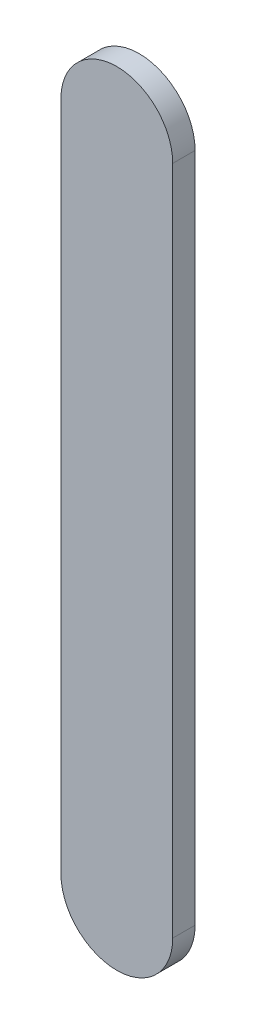
ISO-10303-21;
HEADER;
FILE_DESCRIPTION(('STEP AP214'),'2;1');
FILE_NAME('part.step','',(''),(''),'','','');
FILE_SCHEMA(('AUTOMOTIVE_DESIGN { 1 0 10303 214 1 1 1 1 }'));
ENDSEC;
DATA;
#1=APPLICATION_CONTEXT('core data for automotive mechanical design processes');
#2=APPLICATION_PROTOCOL_DEFINITION('international standard','automotive_design',2000,#1);
#3=PRODUCT_CONTEXT('',#1,'mechanical');
#4=PRODUCT('Part','Part','',(#3));
#5=PRODUCT_RELATED_PRODUCT_CATEGORY('part','',(#4));
#6=PRODUCT_DEFINITION_FORMATION('','',#4);
#7=PRODUCT_DEFINITION_CONTEXT('part definition',#1,'design');
#8=PRODUCT_DEFINITION('design','',#6,#7);
#9=PRODUCT_DEFINITION_SHAPE('','',#8);
#10=(LENGTH_UNIT() NAMED_UNIT(*) SI_UNIT(.MILLI.,.METRE.));
#11=(NAMED_UNIT(*) PLANE_ANGLE_UNIT() SI_UNIT($,.RADIAN.));
#12=(NAMED_UNIT(*) SI_UNIT($,.STERADIAN.) SOLID_ANGLE_UNIT());
#13=UNCERTAINTY_MEASURE_WITH_UNIT(LENGTH_MEASURE(1.E-05),#10,'distance_accuracy_value','');
#14=(GEOMETRIC_REPRESENTATION_CONTEXT(3) GLOBAL_UNCERTAINTY_ASSIGNED_CONTEXT((#13)) GLOBAL_UNIT_ASSIGNED_CONTEXT((#10,
#11,#12)) REPRESENTATION_CONTEXT('',''));
#15=CARTESIAN_POINT('',(0.,0.,0.));
#16=DIRECTION('',(0.,0.,1.));
#17=DIRECTION('',(1.,0.,0.));
#18=AXIS2_PLACEMENT_3D('',#15,#16,#17);
#19=CARTESIAN_POINT('',(6.7837892790863,6.57953159139589,1.));
#20=DIRECTION('',(0.,0.,-1.));
#21=DIRECTION('',(-1.,0.,0.));
#22=AXIS2_PLACEMENT_3D('',#19,#20,#21);
#23=CYLINDRICAL_SURFACE('',#22,2.5);
#24=CARTESIAN_POINT('',(6.7837892790863,6.57953159139589,0.));
#25=DIRECTION('',(0.,0.,1.));
#26=DIRECTION('',(1.,0.,0.));
#27=AXIS2_PLACEMENT_3D('',#24,#25,#26);
#28=CIRCLE('',#27,2.5);
#29=CARTESIAN_POINT('',(9.2837892790863,6.57953159139589,0.));
#30=VERTEX_POINT('',#29);
#31=CARTESIAN_POINT('',(4.2837892790863,6.57953159139589,0.));
#32=VERTEX_POINT('',#31);
#33=EDGE_CURVE('E106',#30,#32,#28,.T.);
#34=ORIENTED_EDGE('',*,*,#33,.T.);
#35=DIRECTION('',(0.,0.,-1.));
#36=VECTOR('',#35,1.);
#37=CARTESIAN_POINT('',(4.2837892790863,6.57953159139589,1.));
#38=LINE('',#37,#36);
#39=CARTESIAN_POINT('',(4.2837892790863,6.57953159139589,1.));
#40=VERTEX_POINT('',#39);
#41=EDGE_CURVE('E13',#40,#32,#38,.T.);
#42=ORIENTED_EDGE('',*,*,#41,.F.);
#43=CARTESIAN_POINT('',(6.7837892790863,6.57953159139589,1.));
#44=DIRECTION('',(0.,0.,1.));
#45=DIRECTION('',(1.,0.,0.));
#46=AXIS2_PLACEMENT_3D('',#43,#44,#45);
#47=CIRCLE('',#46,2.5);
#48=CARTESIAN_POINT('',(9.2837892790863,6.57953159139589,1.));
#49=VERTEX_POINT('',#48);
#50=EDGE_CURVE('E94',#49,#40,#47,.T.);
#51=ORIENTED_EDGE('',*,*,#50,.F.);
#52=DIRECTION('',(0.,0.,-1.));
#53=VECTOR('',#52,1.);
#54=CARTESIAN_POINT('',(9.2837892790863,6.57953159139589,1.));
#55=LINE('',#54,#53);
#56=EDGE_CURVE('E102',#49,#30,#55,.T.);
#57=ORIENTED_EDGE('',*,*,#56,.T.);
#58=EDGE_LOOP('',(#34,#42,#51,#57));
#59=FACE_BOUND('',#58,.T.);
#60=ADVANCED_FACE('F43',(#59),#23,.T.);
#61=CARTESIAN_POINT('',(4.2837892790863,6.57953159139589,1.));
#62=DIRECTION('',(1.,0.,0.));
#63=DIRECTION('',(0.,1.,0.));
#64=AXIS2_PLACEMENT_3D('',#61,#62,#63);
#65=PLANE('',#64);
#66=DIRECTION('',(0.,-1.,0.));
#67=VECTOR('',#66,1.);
#68=CARTESIAN_POINT('',(4.2837892790863,6.57953159139589,0.));
#69=LINE('',#68,#67);
#70=CARTESIAN_POINT('',(4.2837892790863,-23.4204684086041,0.));
#71=VERTEX_POINT('',#70);
#72=EDGE_CURVE('E98',#32,#71,#69,.T.);
#73=ORIENTED_EDGE('',*,*,#72,.T.);
#74=DIRECTION('',(0.,0.,-1.));
#75=VECTOR('',#74,1.);
#76=CARTESIAN_POINT('',(4.2837892790863,-23.4204684086041,1.));
#77=LINE('',#76,#75);
#78=CARTESIAN_POINT('',(4.2837892790863,-23.4204684086041,1.));
#79=VERTEX_POINT('',#78);
#80=EDGE_CURVE('E51',#79,#71,#77,.T.);
#81=ORIENTED_EDGE('',*,*,#80,.F.);
#82=DIRECTION('',(0.,-1.,0.));
#83=VECTOR('',#82,1.);
#84=CARTESIAN_POINT('',(4.2837892790863,6.57953159139589,1.));
#85=LINE('',#84,#83);
#86=EDGE_CURVE('E89',#40,#79,#85,.T.);
#87=ORIENTED_EDGE('',*,*,#86,.F.);
#88=ORIENTED_EDGE('',*,*,#41,.T.);
#89=EDGE_LOOP('',(#73,#81,#87,#88));
#90=FACE_BOUND('',#89,.T.);
#91=ADVANCED_FACE('F97',(#90),#65,.F.);
#92=CARTESIAN_POINT('',(6.7837892790863,-23.4204684086041,1.));
#93=DIRECTION('',(0.,0.,-1.));
#94=DIRECTION('',(-1.,0.,0.));
#95=AXIS2_PLACEMENT_3D('',#92,#93,#94);
#96=CYLINDRICAL_SURFACE('',#95,2.5);
#97=CARTESIAN_POINT('',(6.7837892790863,-23.4204684086041,0.));
#98=DIRECTION('',(0.,0.,1.));
#99=DIRECTION('',(1.,0.,0.));
#100=AXIS2_PLACEMENT_3D('',#97,#98,#99);
#101=CIRCLE('',#100,2.5);
#102=CARTESIAN_POINT('',(9.2837892790863,-23.4204684086041,0.));
#103=VERTEX_POINT('',#102);
#104=EDGE_CURVE('E76',#71,#103,#101,.T.);
#105=ORIENTED_EDGE('',*,*,#104,.T.);
#106=DIRECTION('',(0.,0.,-1.));
#107=VECTOR('',#106,1.);
#108=CARTESIAN_POINT('',(9.2837892790863,-23.4204684086041,1.));
#109=LINE('',#108,#107);
#110=CARTESIAN_POINT('',(9.2837892790863,-23.4204684086041,1.));
#111=VERTEX_POINT('',#110);
#112=EDGE_CURVE('E99',#111,#103,#109,.T.);
#113=ORIENTED_EDGE('',*,*,#112,.F.);
#114=CARTESIAN_POINT('',(6.7837892790863,-23.4204684086041,1.));
#115=DIRECTION('',(0.,0.,1.));
#116=DIRECTION('',(1.,0.,0.));
#117=AXIS2_PLACEMENT_3D('',#114,#115,#116);
#118=CIRCLE('',#117,2.5);
#119=EDGE_CURVE('E92',#79,#111,#118,.T.);
#120=ORIENTED_EDGE('',*,*,#119,.F.);
#121=ORIENTED_EDGE('',*,*,#80,.T.);
#122=EDGE_LOOP('',(#105,#113,#120,#121));
#123=FACE_BOUND('',#122,.T.);
#124=ADVANCED_FACE('F100',(#123),#96,.T.);
#125=CARTESIAN_POINT('',(9.2837892790863,6.57953159139589,1.));
#126=DIRECTION('',(-1.,0.,0.));
#127=DIRECTION('',(0.,0.,1.));
#128=AXIS2_PLACEMENT_3D('',#125,#126,#127);
#129=PLANE('',#128);
#130=DIRECTION('',(0.,1.,0.));
#131=VECTOR('',#130,1.);
#132=CARTESIAN_POINT('',(9.2837892790863,6.57953159139589,0.));
#133=LINE('',#132,#131);
#134=EDGE_CURVE('E82',#103,#30,#133,.T.);
#135=ORIENTED_EDGE('',*,*,#134,.T.);
#136=ORIENTED_EDGE('',*,*,#56,.F.);
#137=DIRECTION('',(0.,1.,0.));
#138=VECTOR('',#137,1.);
#139=CARTESIAN_POINT('',(9.2837892790863,6.57953159139589,1.));
#140=LINE('',#139,#138);
#141=EDGE_CURVE('E59',#111,#49,#140,.T.);
#142=ORIENTED_EDGE('',*,*,#141,.F.);
#143=ORIENTED_EDGE('',*,*,#112,.T.);
#144=EDGE_LOOP('',(#135,#136,#142,#143));
#145=FACE_BOUND('',#144,.T.);
#146=ADVANCED_FACE('F113',(#145),#129,.F.);
#147=CARTESIAN_POINT('',(6.7837892790863,6.57953159139589,1.));
#148=DIRECTION('',(0.,0.,1.));
#149=DIRECTION('',(1.,0.,0.));
#150=AXIS2_PLACEMENT_3D('',#147,#148,#149);
#151=PLANE('',#150);
#152=ORIENTED_EDGE('',*,*,#50,.T.);
#153=ORIENTED_EDGE('',*,*,#86,.T.);
#154=ORIENTED_EDGE('',*,*,#119,.T.);
#155=ORIENTED_EDGE('',*,*,#141,.T.);
#156=EDGE_LOOP('',(#152,#153,#154,#155));
#157=FACE_BOUND('',#156,.T.);
#158=ADVANCED_FACE('F90',(#157),#151,.T.);
#159=CARTESIAN_POINT('',(6.7837892790863,6.57953159139589,0.));
#160=DIRECTION('',(0.,0.,1.));
#161=DIRECTION('',(1.,0.,0.));
#162=AXIS2_PLACEMENT_3D('',#159,#160,#161);
#163=PLANE('',#162);
#164=ORIENTED_EDGE('',*,*,#33,.F.);
#165=ORIENTED_EDGE('',*,*,#134,.F.);
#166=ORIENTED_EDGE('',*,*,#104,.F.);
#167=ORIENTED_EDGE('',*,*,#72,.F.);
#168=EDGE_LOOP('',(#164,#165,#166,#167));
#169=FACE_BOUND('',#168,.T.);
#170=ADVANCED_FACE('F116',(#169),#163,.F.);
#171=CLOSED_SHELL('',(#60,#91,#124,#146,#158,#170));
#172=MANIFOLD_SOLID_BREP('B2',#171);
#173=ADVANCED_BREP_SHAPE_REPRESENTATION('',(#18,#172),#14);
#174=SHAPE_DEFINITION_REPRESENTATION(#9,#173);
ENDSEC;
END-ISO-10303-21;
